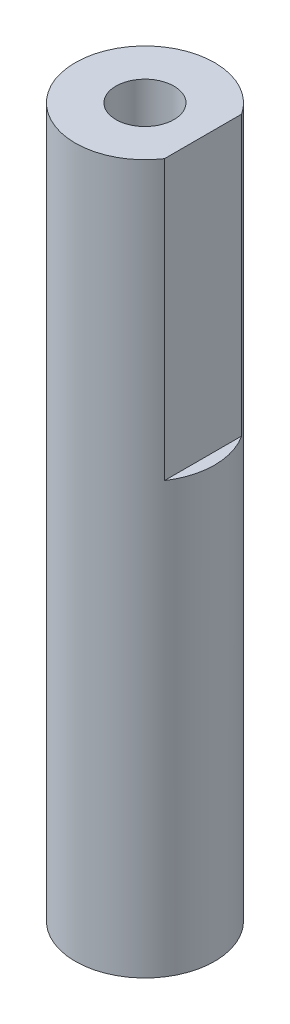
ISO-10303-21;
HEADER;
FILE_DESCRIPTION(('STEP AP214'),'2;1');
FILE_NAME('part.step','',(''),(''),'','','');
FILE_SCHEMA(('AUTOMOTIVE_DESIGN { 1 0 10303 214 1 1 1 1 }'));
ENDSEC;
DATA;
#1=APPLICATION_CONTEXT('core data for automotive mechanical design processes');
#2=APPLICATION_PROTOCOL_DEFINITION('international standard','automotive_design',2000,#1);
#3=PRODUCT_CONTEXT('',#1,'mechanical');
#4=PRODUCT('Part','Part','',(#3));
#5=PRODUCT_RELATED_PRODUCT_CATEGORY('part','',(#4));
#6=PRODUCT_DEFINITION_FORMATION('','',#4);
#7=PRODUCT_DEFINITION_CONTEXT('part definition',#1,'design');
#8=PRODUCT_DEFINITION('design','',#6,#7);
#9=PRODUCT_DEFINITION_SHAPE('','',#8);
#10=(LENGTH_UNIT() NAMED_UNIT(*) SI_UNIT(.MILLI.,.METRE.));
#11=(NAMED_UNIT(*) PLANE_ANGLE_UNIT() SI_UNIT($,.RADIAN.));
#12=(NAMED_UNIT(*) SI_UNIT($,.STERADIAN.) SOLID_ANGLE_UNIT());
#13=UNCERTAINTY_MEASURE_WITH_UNIT(LENGTH_MEASURE(1.E-05),#10,'distance_accuracy_value','');
#14=(GEOMETRIC_REPRESENTATION_CONTEXT(3) GLOBAL_UNCERTAINTY_ASSIGNED_CONTEXT((#13)) GLOBAL_UNIT_ASSIGNED_CONTEXT((#10,
#11,#12)) REPRESENTATION_CONTEXT('',''));
#15=CARTESIAN_POINT('',(0.,0.,0.));
#16=DIRECTION('',(0.,0.,1.));
#17=DIRECTION('',(1.,0.,0.));
#18=AXIS2_PLACEMENT_3D('',#15,#16,#17);
#19=CARTESIAN_POINT('',(0.,-10.,0.));
#20=DIRECTION('',(0.,1.,0.));
#21=DIRECTION('',(0.,0.,1.));
#22=AXIS2_PLACEMENT_3D('',#19,#20,#21);
#23=CYLINDRICAL_SURFACE('',#22,3.);
#24=DIRECTION('',(0.,1.,0.));
#25=VECTOR('',#24,1.);
#26=CARTESIAN_POINT('',(2.5,-10.,1.6583123951777));
#27=LINE('',#26,#25);
#28=CARTESIAN_POINT('',(2.5,20.5,1.6583123951777));
#29=VERTEX_POINT('',#28);
#30=CARTESIAN_POINT('',(2.5,8.5,1.6583123951777));
#31=VERTEX_POINT('',#30);
#32=EDGE_CURVE('E55',#29,#31,#27,.F.);
#33=ORIENTED_EDGE('',*,*,#32,.F.);
#34=CARTESIAN_POINT('',(0.,20.5,0.));
#35=DIRECTION('',(0.,1.,0.));
#36=DIRECTION('',(0.,0.,1.));
#37=AXIS2_PLACEMENT_3D('',#34,#35,#36);
#38=CIRCLE('',#37,3.);
#39=CARTESIAN_POINT('',(2.5,20.5,-1.6583123951777));
#40=VERTEX_POINT('',#39);
#41=EDGE_CURVE('E84',#40,#29,#38,.T.);
#42=ORIENTED_EDGE('',*,*,#41,.F.);
#43=DIRECTION('',(0.,1.,0.));
#44=VECTOR('',#43,1.);
#45=CARTESIAN_POINT('',(2.5,-10.,-1.6583123951777));
#46=LINE('',#45,#44);
#47=CARTESIAN_POINT('',(2.5,8.5,-1.6583123951777));
#48=VERTEX_POINT('',#47);
#49=EDGE_CURVE('E50',#48,#40,#46,.T.);
#50=ORIENTED_EDGE('',*,*,#49,.F.);
#51=CARTESIAN_POINT('',(0.,8.5,0.));
#52=DIRECTION('',(0.,1.,0.));
#53=DIRECTION('',(0.,0.,1.));
#54=AXIS2_PLACEMENT_3D('',#51,#52,#53);
#55=CIRCLE('',#54,3.);
#56=EDGE_CURVE('E11',#48,#31,#55,.F.);
#57=ORIENTED_EDGE('',*,*,#56,.T.);
#58=EDGE_LOOP('',(#33,#42,#50,#57));
#59=FACE_BOUND('',#58,.T.);
#60=CARTESIAN_POINT('',(0.,-10.,0.));
#61=DIRECTION('',(0.,1.,0.));
#62=DIRECTION('',(0.,0.,1.));
#63=AXIS2_PLACEMENT_3D('',#60,#61,#62);
#64=CIRCLE('',#63,3.);
#65=CARTESIAN_POINT('',(0.,-10.,3.));
#66=VERTEX_POINT('',#65);
#67=EDGE_CURVE('E87',#66,#66,#64,.T.);
#68=ORIENTED_EDGE('',*,*,#67,.T.);
#69=EDGE_LOOP('',(#68));
#70=FACE_BOUND('',#69,.T.);
#71=ADVANCED_FACE('F36',(#59,#70),#23,.T.);
#72=CARTESIAN_POINT('',(0.,-10.,0.));
#73=DIRECTION('',(0.,1.,0.));
#74=DIRECTION('',(0.,0.,1.));
#75=AXIS2_PLACEMENT_3D('',#72,#73,#74);
#76=PLANE('',#75);
#77=ORIENTED_EDGE('',*,*,#67,.F.);
#78=EDGE_LOOP('',(#77));
#79=FACE_BOUND('',#78,.T.);
#80=ADVANCED_FACE('F96',(#79),#76,.F.);
#81=CARTESIAN_POINT('',(0.,20.5,0.));
#82=DIRECTION('',(0.,1.,0.));
#83=DIRECTION('',(0.,0.,1.));
#84=AXIS2_PLACEMENT_3D('',#81,#82,#83);
#85=PLANE('',#84);
#86=CARTESIAN_POINT('',(0.,20.5,0.));
#87=DIRECTION('',(0.,1.,0.));
#88=DIRECTION('',(0.,0.,1.));
#89=AXIS2_PLACEMENT_3D('',#86,#87,#88);
#90=CIRCLE('',#89,1.24999999999999);
#91=CARTESIAN_POINT('',(0.,20.5,1.24999999999999));
#92=VERTEX_POINT('',#91);
#93=EDGE_CURVE('E76',#92,#92,#90,.T.);
#94=ORIENTED_EDGE('',*,*,#93,.F.);
#95=EDGE_LOOP('',(#94));
#96=FACE_BOUND('',#95,.T.);
#97=DIRECTION('',(0.,0.,1.));
#98=VECTOR('',#97,1.);
#99=CARTESIAN_POINT('',(2.5,20.5,0.));
#100=LINE('',#99,#98);
#101=EDGE_CURVE('E43',#40,#29,#100,.T.);
#102=ORIENTED_EDGE('',*,*,#101,.F.);
#103=ORIENTED_EDGE('',*,*,#41,.T.);
#104=EDGE_LOOP('',(#102,#103));
#105=FACE_BOUND('',#104,.T.);
#106=ADVANCED_FACE('F94',(#96,#105),#85,.T.);
#107=CARTESIAN_POINT('',(2.5,8.5,-3.));
#108=DIRECTION('',(-1.,0.,0.));
#109=DIRECTION('',(0.,0.,1.));
#110=AXIS2_PLACEMENT_3D('',#107,#108,#109);
#111=PLANE('',#110);
#112=ORIENTED_EDGE('',*,*,#32,.T.);
#113=DIRECTION('',(0.,0.,1.));
#114=VECTOR('',#113,1.);
#115=CARTESIAN_POINT('',(2.5,8.5,-3.));
#116=LINE('',#115,#114);
#117=EDGE_CURVE('E75',#48,#31,#116,.T.);
#118=ORIENTED_EDGE('',*,*,#117,.F.);
#119=ORIENTED_EDGE('',*,*,#49,.T.);
#120=ORIENTED_EDGE('',*,*,#101,.T.);
#121=EDGE_LOOP('',(#112,#118,#119,#120));
#122=FACE_BOUND('',#121,.T.);
#123=ADVANCED_FACE('F89',(#122),#111,.F.);
#124=CARTESIAN_POINT('',(0.,8.5,0.));
#125=DIRECTION('',(0.,1.,0.));
#126=DIRECTION('',(0.,0.,1.));
#127=AXIS2_PLACEMENT_3D('',#124,#125,#126);
#128=PLANE('',#127);
#129=ORIENTED_EDGE('',*,*,#117,.T.);
#130=ORIENTED_EDGE('',*,*,#56,.F.);
#131=EDGE_LOOP('',(#129,#130));
#132=FACE_BOUND('',#131,.T.);
#133=ADVANCED_FACE('F69',(#132),#128,.T.);
#134=CARTESIAN_POINT('',(0.,6.,0.));
#135=DIRECTION('',(0.,1.,0.));
#136=DIRECTION('',(0.,0.,1.));
#137=AXIS2_PLACEMENT_3D('',#134,#135,#136);
#138=CONICAL_SURFACE('',#137,1.25,1.02974425867665);
#139=CARTESIAN_POINT('',(0.,5.24892422621555,0.));
#140=VERTEX_POINT('',#139);
#141=VERTEX_LOOP('',#140);
#142=FACE_BOUND('',#141,.T.);
#143=CARTESIAN_POINT('',(0.,6.,0.));
#144=DIRECTION('',(0.,1.,0.));
#145=DIRECTION('',(0.,0.,1.));
#146=AXIS2_PLACEMENT_3D('',#143,#144,#145);
#147=CIRCLE('',#146,1.25);
#148=CARTESIAN_POINT('',(0.,6.,1.25));
#149=VERTEX_POINT('',#148);
#150=EDGE_CURVE('E73',#149,#149,#147,.T.);
#151=ORIENTED_EDGE('',*,*,#150,.T.);
#152=EDGE_LOOP('',(#151));
#153=FACE_BOUND('',#152,.T.);
#154=ADVANCED_FACE('F65',(#142,#153),#138,.F.);
#155=CARTESIAN_POINT('',(0.,20.5,0.));
#156=DIRECTION('',(0.,1.,0.));
#157=DIRECTION('',(0.,0.,1.));
#158=AXIS2_PLACEMENT_3D('',#155,#156,#157);
#159=CYLINDRICAL_SURFACE('',#158,1.24999999999999);
#160=ORIENTED_EDGE('',*,*,#150,.F.);
#161=EDGE_LOOP('',(#160));
#162=FACE_BOUND('',#161,.T.);
#163=ORIENTED_EDGE('',*,*,#93,.T.);
#164=EDGE_LOOP('',(#163));
#165=FACE_BOUND('',#164,.T.);
#166=ADVANCED_FACE('F68',(#162,#165),#159,.F.);
#167=CLOSED_SHELL('',(#71,#80,#106,#123,#133,#154,#166));
#168=MANIFOLD_SOLID_BREP('B2',#167);
#169=ADVANCED_BREP_SHAPE_REPRESENTATION('',(#18,#168),#14);
#170=SHAPE_DEFINITION_REPRESENTATION(#9,#169);
ENDSEC;
END-ISO-10303-21;
